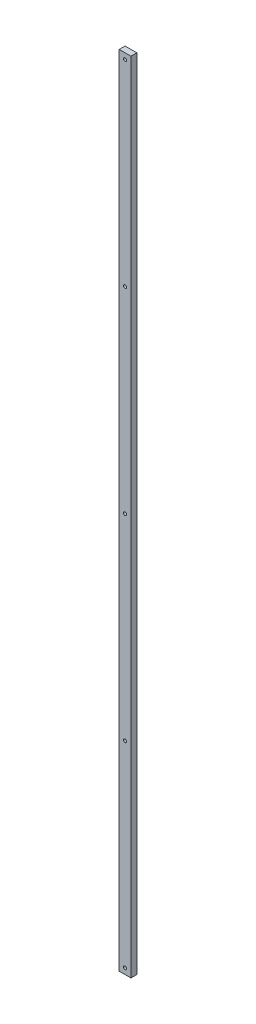
ISO-10303-21;
HEADER;
FILE_DESCRIPTION(('STEP AP214'),'2;1');
FILE_NAME('part.step','',(''),(''),'','','');
FILE_SCHEMA(('AUTOMOTIVE_DESIGN { 1 0 10303 214 1 1 1 1 }'));
ENDSEC;
DATA;
#1=APPLICATION_CONTEXT('core data for automotive mechanical design processes');
#2=APPLICATION_PROTOCOL_DEFINITION('international standard','automotive_design',2000,#1);
#3=PRODUCT_CONTEXT('',#1,'mechanical');
#4=PRODUCT('Part','Part','',(#3));
#5=PRODUCT_RELATED_PRODUCT_CATEGORY('part','',(#4));
#6=PRODUCT_DEFINITION_FORMATION('','',#4);
#7=PRODUCT_DEFINITION_CONTEXT('part definition',#1,'design');
#8=PRODUCT_DEFINITION('design','',#6,#7);
#9=PRODUCT_DEFINITION_SHAPE('','',#8);
#10=(LENGTH_UNIT() NAMED_UNIT(*) SI_UNIT(.MILLI.,.METRE.));
#11=(NAMED_UNIT(*) PLANE_ANGLE_UNIT() SI_UNIT($,.RADIAN.));
#12=(NAMED_UNIT(*) SI_UNIT($,.STERADIAN.) SOLID_ANGLE_UNIT());
#13=UNCERTAINTY_MEASURE_WITH_UNIT(LENGTH_MEASURE(1.E-05),#10,'distance_accuracy_value','');
#14=(GEOMETRIC_REPRESENTATION_CONTEXT(3) GLOBAL_UNCERTAINTY_ASSIGNED_CONTEXT((#13)) GLOBAL_UNIT_ASSIGNED_CONTEXT((#10,
#11,#12)) REPRESENTATION_CONTEXT('',''));
#15=CARTESIAN_POINT('',(0.,0.,0.));
#16=DIRECTION('',(0.,0.,1.));
#17=DIRECTION('',(1.,0.,0.));
#18=AXIS2_PLACEMENT_3D('',#15,#16,#17);
#19=CARTESIAN_POINT('',(12.7,1714.5,0.));
#20=DIRECTION('',(0.,0.,1.));
#21=DIRECTION('',(1.,0.,0.));
#22=AXIS2_PLACEMENT_3D('',#19,#20,#21);
#23=CYLINDRICAL_SURFACE('',#22,3.3655);
#24=CARTESIAN_POINT('',(12.7,1714.5,0.));
#25=DIRECTION('',(0.,0.,1.));
#26=DIRECTION('',(1.,0.,0.));
#27=AXIS2_PLACEMENT_3D('',#24,#25,#26);
#28=CIRCLE('',#27,3.3655);
#29=CARTESIAN_POINT('',(16.0655,1714.5,0.));
#30=VERTEX_POINT('',#29);
#31=EDGE_CURVE('E43',#30,#30,#28,.T.);
#32=ORIENTED_EDGE('',*,*,#31,.F.);
#33=EDGE_LOOP('',(#32));
#34=FACE_BOUND('',#33,.T.);
#35=CARTESIAN_POINT('',(12.7,1714.5,12.7));
#36=DIRECTION('',(0.,0.,1.));
#37=DIRECTION('',(1.,0.,0.));
#38=AXIS2_PLACEMENT_3D('',#35,#36,#37);
#39=CIRCLE('',#38,3.3655);
#40=CARTESIAN_POINT('',(16.0655,1714.5,12.7));
#41=VERTEX_POINT('',#40);
#42=EDGE_CURVE('E11',#41,#41,#39,.T.);
#43=ORIENTED_EDGE('',*,*,#42,.T.);
#44=EDGE_LOOP('',(#43));
#45=FACE_BOUND('',#44,.T.);
#46=ADVANCED_FACE('F35',(#34,#45),#23,.F.);
#47=CARTESIAN_POINT('',(12.7,1289.05,0.));
#48=DIRECTION('',(0.,0.,1.));
#49=DIRECTION('',(1.,0.,0.));
#50=AXIS2_PLACEMENT_3D('',#47,#48,#49);
#51=CYLINDRICAL_SURFACE('',#50,3.3655);
#52=CARTESIAN_POINT('',(12.7,1289.05,0.));
#53=DIRECTION('',(0.,0.,1.));
#54=DIRECTION('',(1.,0.,0.));
#55=AXIS2_PLACEMENT_3D('',#52,#53,#54);
#56=CIRCLE('',#55,3.3655);
#57=CARTESIAN_POINT('',(16.0655,1289.05,0.));
#58=VERTEX_POINT('',#57);
#59=EDGE_CURVE('E119',#58,#58,#56,.T.);
#60=ORIENTED_EDGE('',*,*,#59,.F.);
#61=EDGE_LOOP('',(#60));
#62=FACE_BOUND('',#61,.T.);
#63=CARTESIAN_POINT('',(12.7,1289.05,12.7));
#64=DIRECTION('',(0.,0.,1.));
#65=DIRECTION('',(1.,0.,0.));
#66=AXIS2_PLACEMENT_3D('',#63,#64,#65);
#67=CIRCLE('',#66,3.3655);
#68=CARTESIAN_POINT('',(16.0655,1289.05,12.7));
#69=VERTEX_POINT('',#68);
#70=EDGE_CURVE('E122',#69,#69,#67,.T.);
#71=ORIENTED_EDGE('',*,*,#70,.T.);
#72=EDGE_LOOP('',(#71));
#73=FACE_BOUND('',#72,.T.);
#74=ADVANCED_FACE('F131',(#62,#73),#51,.F.);
#75=CARTESIAN_POINT('',(12.7,863.6,0.));
#76=DIRECTION('',(0.,0.,1.));
#77=DIRECTION('',(1.,0.,0.));
#78=AXIS2_PLACEMENT_3D('',#75,#76,#77);
#79=CYLINDRICAL_SURFACE('',#78,3.3655);
#80=CARTESIAN_POINT('',(12.7,863.6,0.));
#81=DIRECTION('',(0.,0.,1.));
#82=DIRECTION('',(1.,0.,0.));
#83=AXIS2_PLACEMENT_3D('',#80,#81,#82);
#84=CIRCLE('',#83,3.3655);
#85=CARTESIAN_POINT('',(16.0655,863.6,0.));
#86=VERTEX_POINT('',#85);
#87=EDGE_CURVE('E113',#86,#86,#84,.T.);
#88=ORIENTED_EDGE('',*,*,#87,.F.);
#89=EDGE_LOOP('',(#88));
#90=FACE_BOUND('',#89,.T.);
#91=CARTESIAN_POINT('',(12.7,863.6,12.7));
#92=DIRECTION('',(0.,0.,1.));
#93=DIRECTION('',(1.,0.,0.));
#94=AXIS2_PLACEMENT_3D('',#91,#92,#93);
#95=CIRCLE('',#94,3.3655);
#96=CARTESIAN_POINT('',(16.0655,863.6,12.7));
#97=VERTEX_POINT('',#96);
#98=EDGE_CURVE('E116',#97,#97,#95,.T.);
#99=ORIENTED_EDGE('',*,*,#98,.T.);
#100=EDGE_LOOP('',(#99));
#101=FACE_BOUND('',#100,.T.);
#102=ADVANCED_FACE('F158',(#90,#101),#79,.F.);
#103=CARTESIAN_POINT('',(0.,1727.2,12.7));
#104=DIRECTION('',(1.,0.,0.));
#105=DIRECTION('',(0.,1.,0.));
#106=AXIS2_PLACEMENT_3D('',#103,#104,#105);
#107=PLANE('',#106);
#108=DIRECTION('',(0.,-1.,0.));
#109=VECTOR('',#108,1.);
#110=CARTESIAN_POINT('',(0.,1727.2,0.));
#111=LINE('',#110,#109);
#112=CARTESIAN_POINT('',(0.,1727.2,0.));
#113=VERTEX_POINT('',#112);
#114=CARTESIAN_POINT('',(0.,0.,0.));
#115=VERTEX_POINT('',#114);
#116=EDGE_CURVE('E103',#113,#115,#111,.T.);
#117=ORIENTED_EDGE('',*,*,#116,.T.);
#118=DIRECTION('',(0.,0.,-1.));
#119=VECTOR('',#118,1.);
#120=CARTESIAN_POINT('',(0.,0.,12.7));
#121=LINE('',#120,#119);
#122=CARTESIAN_POINT('',(0.,0.,12.7));
#123=VERTEX_POINT('',#122);
#124=EDGE_CURVE('E94',#123,#115,#121,.T.);
#125=ORIENTED_EDGE('',*,*,#124,.F.);
#126=DIRECTION('',(0.,-1.,0.));
#127=VECTOR('',#126,1.);
#128=CARTESIAN_POINT('',(0.,1727.2,12.7));
#129=LINE('',#128,#127);
#130=CARTESIAN_POINT('',(0.,1727.2,12.7));
#131=VERTEX_POINT('',#130);
#132=EDGE_CURVE('E88',#131,#123,#129,.T.);
#133=ORIENTED_EDGE('',*,*,#132,.F.);
#134=DIRECTION('',(0.,0.,-1.));
#135=VECTOR('',#134,1.);
#136=CARTESIAN_POINT('',(0.,1727.2,12.7));
#137=LINE('',#136,#135);
#138=EDGE_CURVE('E99',#131,#113,#137,.T.);
#139=ORIENTED_EDGE('',*,*,#138,.T.);
#140=EDGE_LOOP('',(#117,#125,#133,#139));
#141=FACE_BOUND('',#140,.T.);
#142=ADVANCED_FACE('F155',(#141),#107,.F.);
#143=CARTESIAN_POINT('',(0.,0.,12.7));
#144=DIRECTION('',(0.,1.,0.));
#145=DIRECTION('',(0.,0.,1.));
#146=AXIS2_PLACEMENT_3D('',#143,#144,#145);
#147=PLANE('',#146);
#148=DIRECTION('',(1.,0.,0.));
#149=VECTOR('',#148,1.);
#150=CARTESIAN_POINT('',(0.,0.,0.));
#151=LINE('',#150,#149);
#152=CARTESIAN_POINT('',(25.4,0.,0.));
#153=VERTEX_POINT('',#152);
#154=EDGE_CURVE('E93',#115,#153,#151,.T.);
#155=ORIENTED_EDGE('',*,*,#154,.T.);
#156=DIRECTION('',(0.,0.,-1.));
#157=VECTOR('',#156,1.);
#158=CARTESIAN_POINT('',(25.4,0.,12.7));
#159=LINE('',#158,#157);
#160=CARTESIAN_POINT('',(25.4,0.,12.7));
#161=VERTEX_POINT('',#160);
#162=EDGE_CURVE('E91',#161,#153,#159,.T.);
#163=ORIENTED_EDGE('',*,*,#162,.F.);
#164=DIRECTION('',(1.,0.,0.));
#165=VECTOR('',#164,1.);
#166=CARTESIAN_POINT('',(0.,0.,12.7));
#167=LINE('',#166,#165);
#168=EDGE_CURVE('E82',#123,#161,#167,.T.);
#169=ORIENTED_EDGE('',*,*,#168,.F.);
#170=ORIENTED_EDGE('',*,*,#124,.T.);
#171=EDGE_LOOP('',(#155,#163,#169,#170));
#172=FACE_BOUND('',#171,.T.);
#173=ADVANCED_FACE('F92',(#172),#147,.F.);
#174=CARTESIAN_POINT('',(25.4,0.,12.7));
#175=DIRECTION('',(-1.,0.,0.));
#176=DIRECTION('',(0.,0.,1.));
#177=AXIS2_PLACEMENT_3D('',#174,#175,#176);
#178=PLANE('',#177);
#179=DIRECTION('',(0.,1.,0.));
#180=VECTOR('',#179,1.);
#181=CARTESIAN_POINT('',(25.4,0.,0.));
#182=LINE('',#181,#180);
#183=CARTESIAN_POINT('',(25.4,1727.2,0.));
#184=VERTEX_POINT('',#183);
#185=EDGE_CURVE('E68',#153,#184,#182,.T.);
#186=ORIENTED_EDGE('',*,*,#185,.T.);
#187=DIRECTION('',(0.,0.,-1.));
#188=VECTOR('',#187,1.);
#189=CARTESIAN_POINT('',(25.4,1727.2,12.7));
#190=LINE('',#189,#188);
#191=CARTESIAN_POINT('',(25.4,1727.2,12.7));
#192=VERTEX_POINT('',#191);
#193=EDGE_CURVE('E95',#192,#184,#190,.T.);
#194=ORIENTED_EDGE('',*,*,#193,.F.);
#195=DIRECTION('',(0.,1.,0.));
#196=VECTOR('',#195,1.);
#197=CARTESIAN_POINT('',(25.4,0.,12.7));
#198=LINE('',#197,#196);
#199=EDGE_CURVE('E86',#161,#192,#198,.T.);
#200=ORIENTED_EDGE('',*,*,#199,.F.);
#201=ORIENTED_EDGE('',*,*,#162,.T.);
#202=EDGE_LOOP('',(#186,#194,#200,#201));
#203=FACE_BOUND('',#202,.T.);
#204=ADVANCED_FACE('F97',(#203),#178,.F.);
#205=CARTESIAN_POINT('',(0.,1727.2,12.7));
#206=DIRECTION('',(0.,-1.,0.));
#207=DIRECTION('',(0.,0.,-1.));
#208=AXIS2_PLACEMENT_3D('',#205,#206,#207);
#209=PLANE('',#208);
#210=DIRECTION('',(-1.,0.,0.));
#211=VECTOR('',#210,1.);
#212=CARTESIAN_POINT('',(0.,1727.2,0.));
#213=LINE('',#212,#211);
#214=EDGE_CURVE('E74',#184,#113,#213,.T.);
#215=ORIENTED_EDGE('',*,*,#214,.T.);
#216=ORIENTED_EDGE('',*,*,#138,.F.);
#217=DIRECTION('',(-1.,0.,0.));
#218=VECTOR('',#217,1.);
#219=CARTESIAN_POINT('',(0.,1727.2,12.7));
#220=LINE('',#219,#218);
#221=EDGE_CURVE('E51',#192,#131,#220,.T.);
#222=ORIENTED_EDGE('',*,*,#221,.F.);
#223=ORIENTED_EDGE('',*,*,#193,.T.);
#224=EDGE_LOOP('',(#215,#216,#222,#223));
#225=FACE_BOUND('',#224,.T.);
#226=ADVANCED_FACE('F135',(#225),#209,.F.);
#227=CARTESIAN_POINT('',(0.,0.,12.7));
#228=DIRECTION('',(0.,0.,1.));
#229=DIRECTION('',(1.,0.,0.));
#230=AXIS2_PLACEMENT_3D('',#227,#228,#229);
#231=PLANE('',#230);
#232=CARTESIAN_POINT('',(12.7,438.15,12.7));
#233=DIRECTION('',(0.,0.,1.));
#234=DIRECTION('',(1.,0.,0.));
#235=AXIS2_PLACEMENT_3D('',#232,#233,#234);
#236=CIRCLE('',#235,3.3655);
#237=CARTESIAN_POINT('',(16.0655,438.15,12.7));
#238=VERTEX_POINT('',#237);
#239=EDGE_CURVE('E237',#238,#238,#236,.T.);
#240=ORIENTED_EDGE('',*,*,#239,.F.);
#241=EDGE_LOOP('',(#240));
#242=FACE_BOUND('',#241,.T.);
#243=CARTESIAN_POINT('',(12.7,12.7,12.7));
#244=DIRECTION('',(0.,0.,1.));
#245=DIRECTION('',(1.,0.,0.));
#246=AXIS2_PLACEMENT_3D('',#243,#244,#245);
#247=CIRCLE('',#246,3.3655);
#248=CARTESIAN_POINT('',(16.0655,12.7,12.7));
#249=VERTEX_POINT('',#248);
#250=EDGE_CURVE('E238',#249,#249,#247,.T.);
#251=ORIENTED_EDGE('',*,*,#250,.F.);
#252=EDGE_LOOP('',(#251));
#253=FACE_BOUND('',#252,.T.);
#254=ORIENTED_EDGE('',*,*,#132,.T.);
#255=ORIENTED_EDGE('',*,*,#168,.T.);
#256=ORIENTED_EDGE('',*,*,#199,.T.);
#257=ORIENTED_EDGE('',*,*,#221,.T.);
#258=EDGE_LOOP('',(#254,#255,#256,#257));
#259=FACE_BOUND('',#258,.T.);
#260=ORIENTED_EDGE('',*,*,#98,.F.);
#261=EDGE_LOOP('',(#260));
#262=FACE_BOUND('',#261,.T.);
#263=ORIENTED_EDGE('',*,*,#70,.F.);
#264=EDGE_LOOP('',(#263));
#265=FACE_BOUND('',#264,.T.);
#266=ORIENTED_EDGE('',*,*,#42,.F.);
#267=EDGE_LOOP('',(#266));
#268=FACE_BOUND('',#267,.T.);
#269=ADVANCED_FACE('F83',(#242,#253,#259,#262,#265,#268),#231,.T.);
#270=CARTESIAN_POINT('',(0.,0.,0.));
#271=DIRECTION('',(0.,0.,1.));
#272=DIRECTION('',(1.,0.,0.));
#273=AXIS2_PLACEMENT_3D('',#270,#271,#272);
#274=PLANE('',#273);
#275=CARTESIAN_POINT('',(12.7,438.15,0.));
#276=DIRECTION('',(0.,0.,1.));
#277=DIRECTION('',(1.,0.,0.));
#278=AXIS2_PLACEMENT_3D('',#275,#276,#277);
#279=CIRCLE('',#278,3.3655);
#280=CARTESIAN_POINT('',(16.0655,438.15,0.));
#281=VERTEX_POINT('',#280);
#282=EDGE_CURVE('E235',#281,#281,#279,.T.);
#283=ORIENTED_EDGE('',*,*,#282,.T.);
#284=EDGE_LOOP('',(#283));
#285=FACE_BOUND('',#284,.T.);
#286=CARTESIAN_POINT('',(12.7,12.7,0.));
#287=DIRECTION('',(0.,0.,1.));
#288=DIRECTION('',(1.,0.,0.));
#289=AXIS2_PLACEMENT_3D('',#286,#287,#288);
#290=CIRCLE('',#289,3.3655);
#291=CARTESIAN_POINT('',(16.0655,12.7,0.));
#292=VERTEX_POINT('',#291);
#293=EDGE_CURVE('E106',#292,#292,#290,.T.);
#294=ORIENTED_EDGE('',*,*,#293,.T.);
#295=EDGE_LOOP('',(#294));
#296=FACE_BOUND('',#295,.T.);
#297=ORIENTED_EDGE('',*,*,#116,.F.);
#298=ORIENTED_EDGE('',*,*,#214,.F.);
#299=ORIENTED_EDGE('',*,*,#185,.F.);
#300=ORIENTED_EDGE('',*,*,#154,.F.);
#301=EDGE_LOOP('',(#297,#298,#299,#300));
#302=FACE_BOUND('',#301,.T.);
#303=ORIENTED_EDGE('',*,*,#87,.T.);
#304=EDGE_LOOP('',(#303));
#305=FACE_BOUND('',#304,.T.);
#306=ORIENTED_EDGE('',*,*,#59,.T.);
#307=EDGE_LOOP('',(#306));
#308=FACE_BOUND('',#307,.T.);
#309=ORIENTED_EDGE('',*,*,#31,.T.);
#310=EDGE_LOOP('',(#309));
#311=FACE_BOUND('',#310,.T.);
#312=ADVANCED_FACE('F127',(#285,#296,#302,#305,#308,#311),#274,.F.);
#313=CARTESIAN_POINT('',(12.7,12.7,0.));
#314=DIRECTION('',(0.,0.,1.));
#315=DIRECTION('',(1.,0.,0.));
#316=AXIS2_PLACEMENT_3D('',#313,#314,#315);
#317=CYLINDRICAL_SURFACE('',#316,3.3655);
#318=ORIENTED_EDGE('',*,*,#293,.F.);
#319=EDGE_LOOP('',(#318));
#320=FACE_BOUND('',#319,.T.);
#321=ORIENTED_EDGE('',*,*,#250,.T.);
#322=EDGE_LOOP('',(#321));
#323=FACE_BOUND('',#322,.T.);
#324=ADVANCED_FACE('F142',(#320,#323),#317,.F.);
#325=CARTESIAN_POINT('',(12.7,438.15,0.));
#326=DIRECTION('',(0.,0.,1.));
#327=DIRECTION('',(1.,0.,0.));
#328=AXIS2_PLACEMENT_3D('',#325,#326,#327);
#329=CYLINDRICAL_SURFACE('',#328,3.3655);
#330=ORIENTED_EDGE('',*,*,#282,.F.);
#331=EDGE_LOOP('',(#330));
#332=FACE_BOUND('',#331,.T.);
#333=ORIENTED_EDGE('',*,*,#239,.T.);
#334=EDGE_LOOP('',(#333));
#335=FACE_BOUND('',#334,.T.);
#336=ADVANCED_FACE('F202',(#332,#335),#329,.F.);
#337=CLOSED_SHELL('',(#46,#74,#102,#142,#173,#204,#226,#269,#312,#324,#336));
#338=MANIFOLD_SOLID_BREP('B2',#337);
#339=ADVANCED_BREP_SHAPE_REPRESENTATION('',(#18,#338),#14);
#340=SHAPE_DEFINITION_REPRESENTATION(#9,#339);
ENDSEC;
END-ISO-10303-21;
